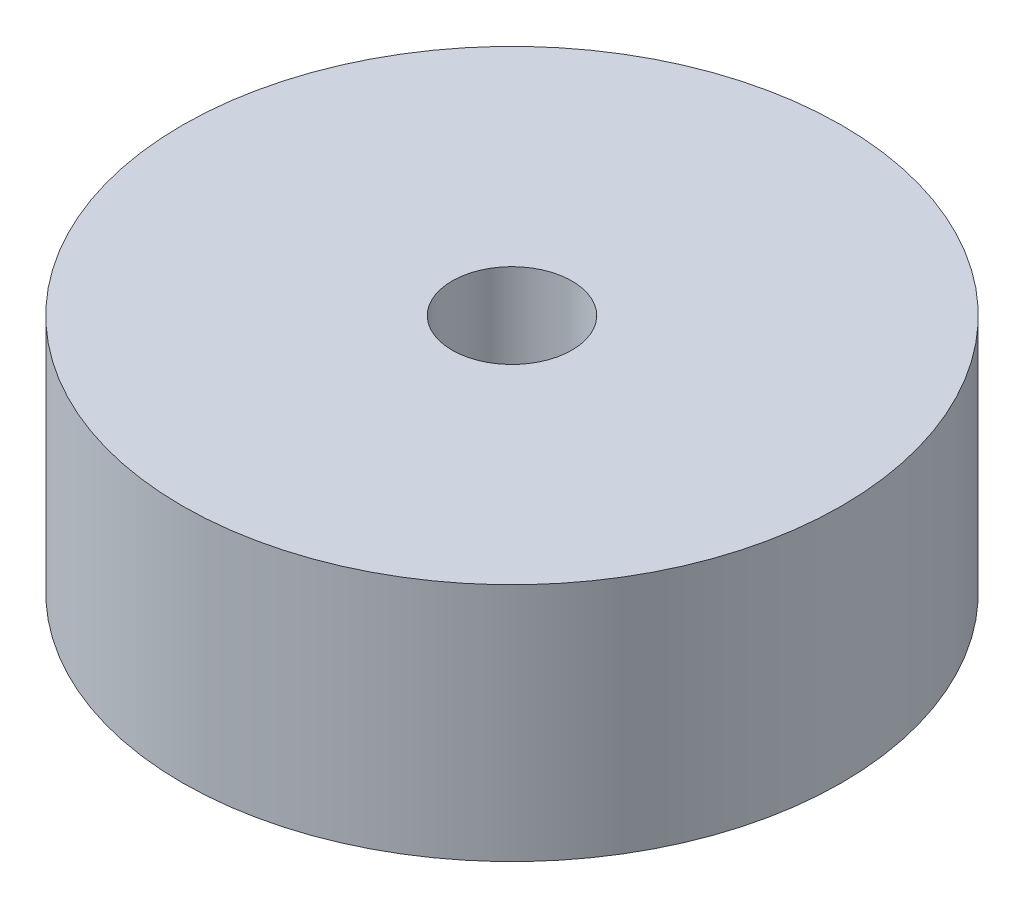
ISO-10303-21;
HEADER;
FILE_DESCRIPTION(('STEP AP214'),'2;1');
FILE_NAME('part.step','',(''),(''),'','','');
FILE_SCHEMA(('AUTOMOTIVE_DESIGN { 1 0 10303 214 1 1 1 1 }'));
ENDSEC;
DATA;
#1=APPLICATION_CONTEXT('core data for automotive mechanical design processes');
#2=APPLICATION_PROTOCOL_DEFINITION('international standard','automotive_design',2000,#1);
#3=PRODUCT_CONTEXT('',#1,'mechanical');
#4=PRODUCT('Part','Part','',(#3));
#5=PRODUCT_RELATED_PRODUCT_CATEGORY('part','',(#4));
#6=PRODUCT_DEFINITION_FORMATION('','',#4);
#7=PRODUCT_DEFINITION_CONTEXT('part definition',#1,'design');
#8=PRODUCT_DEFINITION('design','',#6,#7);
#9=PRODUCT_DEFINITION_SHAPE('','',#8);
#10=(LENGTH_UNIT() NAMED_UNIT(*) SI_UNIT(.MILLI.,.METRE.));
#11=(NAMED_UNIT(*) PLANE_ANGLE_UNIT() SI_UNIT($,.RADIAN.));
#12=(NAMED_UNIT(*) SI_UNIT($,.STERADIAN.) SOLID_ANGLE_UNIT());
#13=UNCERTAINTY_MEASURE_WITH_UNIT(LENGTH_MEASURE(1.E-05),#10,'distance_accuracy_value','');
#14=(GEOMETRIC_REPRESENTATION_CONTEXT(3) GLOBAL_UNCERTAINTY_ASSIGNED_CONTEXT((#13)) GLOBAL_UNIT_ASSIGNED_CONTEXT((#10,
#11,#12)) REPRESENTATION_CONTEXT('',''));
#15=CARTESIAN_POINT('',(0.,0.,0.));
#16=DIRECTION('',(0.,0.,1.));
#17=DIRECTION('',(1.,0.,0.));
#18=AXIS2_PLACEMENT_3D('',#15,#16,#17);
#19=CARTESIAN_POINT('',(0.,25.4,0.));
#20=DIRECTION('',(0.,1.,0.));
#21=DIRECTION('',(0.,0.,1.));
#22=AXIS2_PLACEMENT_3D('',#19,#20,#21);
#23=PLANE('',#22);
#24=CARTESIAN_POINT('',(0.,25.4,0.));
#25=DIRECTION('',(0.,1.,0.));
#26=DIRECTION('',(0.,0.,1.));
#27=AXIS2_PLACEMENT_3D('',#24,#25,#26);
#28=CIRCLE('',#27,34.925);
#29=CARTESIAN_POINT('',(0.,25.4,34.925));
#30=VERTEX_POINT('',#29);
#31=EDGE_CURVE('E10',#30,#30,#28,.T.);
#32=ORIENTED_EDGE('',*,*,#31,.T.);
#33=EDGE_LOOP('',(#32));
#34=FACE_BOUND('',#33,.T.);
#35=CARTESIAN_POINT('',(0.,25.4,0.));
#36=DIRECTION('',(0.,1.,0.));
#37=DIRECTION('',(0.,0.,1.));
#38=AXIS2_PLACEMENT_3D('',#35,#36,#37);
#39=CIRCLE('',#38,6.35);
#40=CARTESIAN_POINT('',(0.,25.4,6.35));
#41=VERTEX_POINT('',#40);
#42=EDGE_CURVE('E46',#41,#41,#39,.T.);
#43=ORIENTED_EDGE('',*,*,#42,.F.);
#44=EDGE_LOOP('',(#43));
#45=FACE_BOUND('',#44,.T.);
#46=ADVANCED_FACE('F35',(#34,#45),#23,.T.);
#47=CARTESIAN_POINT('',(0.,0.,0.));
#48=DIRECTION('',(0.,1.,0.));
#49=DIRECTION('',(0.,0.,1.));
#50=AXIS2_PLACEMENT_3D('',#47,#48,#49);
#51=PLANE('',#50);
#52=CARTESIAN_POINT('',(0.,0.,0.));
#53=DIRECTION('',(0.,1.,0.));
#54=DIRECTION('',(0.,0.,1.));
#55=AXIS2_PLACEMENT_3D('',#52,#53,#54);
#56=CIRCLE('',#55,34.925);
#57=CARTESIAN_POINT('',(0.,0.,34.925));
#58=VERTEX_POINT('',#57);
#59=EDGE_CURVE('E39',#58,#58,#56,.T.);
#60=ORIENTED_EDGE('',*,*,#59,.F.);
#61=EDGE_LOOP('',(#60));
#62=FACE_BOUND('',#61,.T.);
#63=CARTESIAN_POINT('',(0.,0.,0.));
#64=DIRECTION('',(0.,1.,0.));
#65=DIRECTION('',(0.,0.,1.));
#66=AXIS2_PLACEMENT_3D('',#63,#64,#65);
#67=CIRCLE('',#66,6.35);
#68=CARTESIAN_POINT('',(0.,0.,6.35));
#69=VERTEX_POINT('',#68);
#70=EDGE_CURVE('E48',#69,#69,#67,.T.);
#71=ORIENTED_EDGE('',*,*,#70,.T.);
#72=EDGE_LOOP('',(#71));
#73=FACE_BOUND('',#72,.T.);
#74=ADVANCED_FACE('F58',(#62,#73),#51,.F.);
#75=CARTESIAN_POINT('',(0.,25.4,0.));
#76=DIRECTION('',(0.,-1.,0.));
#77=DIRECTION('',(0.,0.,-1.));
#78=AXIS2_PLACEMENT_3D('',#75,#76,#77);
#79=CYLINDRICAL_SURFACE('',#78,34.925);
#80=ORIENTED_EDGE('',*,*,#31,.F.);
#81=EDGE_LOOP('',(#80));
#82=FACE_BOUND('',#81,.T.);
#83=ORIENTED_EDGE('',*,*,#59,.T.);
#84=EDGE_LOOP('',(#83));
#85=FACE_BOUND('',#84,.T.);
#86=ADVANCED_FACE('F37',(#82,#85),#79,.T.);
#87=CARTESIAN_POINT('',(0.,25.4,0.));
#88=DIRECTION('',(0.,-1.,0.));
#89=DIRECTION('',(0.,0.,-1.));
#90=AXIS2_PLACEMENT_3D('',#87,#88,#89);
#91=CYLINDRICAL_SURFACE('',#90,6.35);
#92=ORIENTED_EDGE('',*,*,#42,.T.);
#93=EDGE_LOOP('',(#92));
#94=FACE_BOUND('',#93,.T.);
#95=ORIENTED_EDGE('',*,*,#70,.F.);
#96=EDGE_LOOP('',(#95));
#97=FACE_BOUND('',#96,.T.);
#98=ADVANCED_FACE('F54',(#94,#97),#91,.F.);
#99=CLOSED_SHELL('',(#46,#74,#86,#98));
#100=MANIFOLD_SOLID_BREP('B2',#99);
#101=ADVANCED_BREP_SHAPE_REPRESENTATION('',(#18,#100),#14);
#102=SHAPE_DEFINITION_REPRESENTATION(#9,#101);
ENDSEC;
END-ISO-10303-21;
